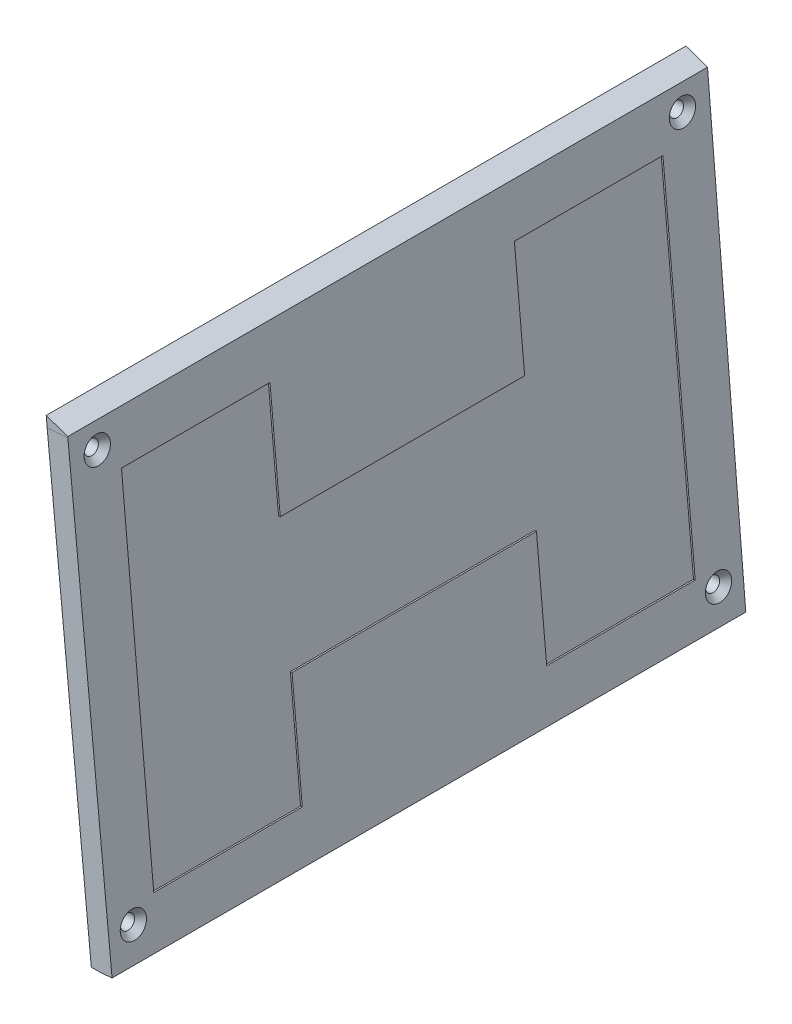
ISO-10303-21;
HEADER;
FILE_DESCRIPTION(('STEP AP214'),'2;1');
FILE_NAME('part.step','',(''),(''),'','','');
FILE_SCHEMA(('AUTOMOTIVE_DESIGN { 1 0 10303 214 1 1 1 1 }'));
ENDSEC;
DATA;
#1=APPLICATION_CONTEXT('core data for automotive mechanical design processes');
#2=APPLICATION_PROTOCOL_DEFINITION('international standard','automotive_design',2000,#1);
#3=PRODUCT_CONTEXT('',#1,'mechanical');
#4=PRODUCT('Part','Part','',(#3));
#5=PRODUCT_RELATED_PRODUCT_CATEGORY('part','',(#4));
#6=PRODUCT_DEFINITION_FORMATION('','',#4);
#7=PRODUCT_DEFINITION_CONTEXT('part definition',#1,'design');
#8=PRODUCT_DEFINITION('design','',#6,#7);
#9=PRODUCT_DEFINITION_SHAPE('','',#8);
#10=(LENGTH_UNIT() NAMED_UNIT(*) SI_UNIT(.MILLI.,.METRE.));
#11=(NAMED_UNIT(*) PLANE_ANGLE_UNIT() SI_UNIT($,.RADIAN.));
#12=(NAMED_UNIT(*) SI_UNIT($,.STERADIAN.) SOLID_ANGLE_UNIT());
#13=UNCERTAINTY_MEASURE_WITH_UNIT(LENGTH_MEASURE(1.E-05),#10,'distance_accuracy_value','');
#14=(GEOMETRIC_REPRESENTATION_CONTEXT(3) GLOBAL_UNCERTAINTY_ASSIGNED_CONTEXT((#13)) GLOBAL_UNIT_ASSIGNED_CONTEXT((#10,
#11,#12)) REPRESENTATION_CONTEXT('',''));
#15=CARTESIAN_POINT('',(0.,0.,0.));
#16=DIRECTION('',(0.,0.,1.));
#17=DIRECTION('',(1.,0.,0.));
#18=AXIS2_PLACEMENT_3D('',#15,#16,#17);
#19=CARTESIAN_POINT('',(178.098352013138,16.3444690138639,0.));
#20=DIRECTION('',(0.995815350334901,0.0913881175940254,0.));
#21=DIRECTION('',(-0.0913881175940254,0.995815350334901,0.));
#22=AXIS2_PLACEMENT_3D('',#19,#20,#21);
#23=PLANE('',#22);
#24=DIRECTION('',(0.,0.,1.));
#25=VECTOR('',#24,1.);
#26=CARTESIAN_POINT('',(170.741912243986,96.5042954639308,29.408644765289));
#27=LINE('',#26,#25);
#28=CARTESIAN_POINT('',(170.741912243986,96.5042954639308,29.408644765289));
#29=VERTEX_POINT('',#28);
#30=CARTESIAN_POINT('',(170.741912243986,96.5042954639308,65.1489376110085));
#31=VERTEX_POINT('',#30);
#32=EDGE_CURVE('E397',#29,#31,#27,.T.);
#33=ORIENTED_EDGE('',*,*,#32,.T.);
#34=DIRECTION('',(0.0913881175940254,-0.9958153503349,0.));
#35=VECTOR('',#34,1.);
#36=CARTESIAN_POINT('',(170.741912243986,96.5042954639308,65.1489376110085));
#37=LINE('',#36,#35);
#38=CARTESIAN_POINT('',(178.505016448738,11.9132289569812,65.1489376110085));
#39=VERTEX_POINT('',#38);
#40=EDGE_CURVE('E392',#31,#39,#37,.T.);
#41=ORIENTED_EDGE('',*,*,#40,.T.);
#42=DIRECTION('',(0.,0.,-1.));
#43=VECTOR('',#42,1.);
#44=CARTESIAN_POINT('',(178.505016448738,11.9132289569812,65.1489376110085));
#45=LINE('',#44,#43);
#46=CARTESIAN_POINT('',(178.505016448738,11.9132289569812,29.408644765289));
#47=VERTEX_POINT('',#46);
#48=EDGE_CURVE('E390',#39,#47,#45,.T.);
#49=ORIENTED_EDGE('',*,*,#48,.T.);
#50=DIRECTION('',(-0.0913881175940259,0.995815350334901,0.));
#51=VECTOR('',#50,1.);
#52=CARTESIAN_POINT('',(178.505016448738,11.9132289569812,29.408644765289));
#53=LINE('',#52,#51);
#54=CARTESIAN_POINT('',(176.046366702729,38.7040330859093,29.408644765289));
#55=VERTEX_POINT('',#54);
#56=EDGE_CURVE('E370',#47,#55,#53,.T.);
#57=ORIENTED_EDGE('',*,*,#56,.T.);
#58=DIRECTION('',(0.,0.,-1.));
#59=VECTOR('',#58,1.);
#60=CARTESIAN_POINT('',(176.046366702729,38.7040330859093,29.408644765289));
#61=LINE('',#60,#59);
#62=CARTESIAN_POINT('',(176.046366702729,38.7040330859093,-29.408644765289));
#63=VERTEX_POINT('',#62);
#64=EDGE_CURVE('E380',#55,#63,#61,.T.);
#65=ORIENTED_EDGE('',*,*,#64,.T.);
#66=DIRECTION('',(0.0913881175940259,-0.995815350334901,0.));
#67=VECTOR('',#66,1.);
#68=CARTESIAN_POINT('',(176.046366702729,38.7040330859093,-29.408644765289));
#69=LINE('',#68,#67);
#70=CARTESIAN_POINT('',(178.505016448738,11.9132289569812,-29.408644765289));
#71=VERTEX_POINT('',#70);
#72=EDGE_CURVE('E386',#63,#71,#69,.T.);
#73=ORIENTED_EDGE('',*,*,#72,.T.);
#74=DIRECTION('',(0.,0.,-1.));
#75=VECTOR('',#74,1.);
#76=CARTESIAN_POINT('',(178.505016448738,11.9132289569812,-29.408644765289));
#77=LINE('',#76,#75);
#78=CARTESIAN_POINT('',(178.505016448738,11.9132289569812,-65.1489376110086));
#79=VERTEX_POINT('',#78);
#80=EDGE_CURVE('E542',#71,#79,#77,.T.);
#81=ORIENTED_EDGE('',*,*,#80,.T.);
#82=DIRECTION('',(-0.0913881175940257,0.995815350334901,0.));
#83=VECTOR('',#82,1.);
#84=CARTESIAN_POINT('',(178.505016448738,11.9132289569812,-65.1489376110086));
#85=LINE('',#84,#83);
#86=CARTESIAN_POINT('',(170.741912243986,96.5042954639308,-65.1489376110086));
#87=VERTEX_POINT('',#86);
#88=EDGE_CURVE('E539',#79,#87,#85,.T.);
#89=ORIENTED_EDGE('',*,*,#88,.T.);
#90=DIRECTION('',(0.,0.,1.));
#91=VECTOR('',#90,1.);
#92=CARTESIAN_POINT('',(170.741912243986,96.5042954639308,-65.1489376110086));
#93=LINE('',#92,#91);
#94=CARTESIAN_POINT('',(170.741912243986,96.5042954639308,-29.408644765289));
#95=VERTEX_POINT('',#94);
#96=EDGE_CURVE('E536',#87,#95,#93,.T.);
#97=ORIENTED_EDGE('',*,*,#96,.T.);
#98=DIRECTION('',(0.0913881175940248,-0.9958153503349,0.));
#99=VECTOR('',#98,1.);
#100=CARTESIAN_POINT('',(170.741912243986,96.5042954639308,-29.408644765289));
#101=LINE('',#100,#99);
#102=CARTESIAN_POINT('',(173.200561989995,69.7134913350027,-29.408644765289));
#103=VERTEX_POINT('',#102);
#104=EDGE_CURVE('E533',#95,#103,#101,.T.);
#105=ORIENTED_EDGE('',*,*,#104,.T.);
#106=DIRECTION('',(0.,0.,1.));
#107=VECTOR('',#106,1.);
#108=CARTESIAN_POINT('',(173.200561989995,69.7134913350027,-29.408644765289));
#109=LINE('',#108,#107);
#110=CARTESIAN_POINT('',(173.200561989995,69.7134913350027,29.408644765289));
#111=VERTEX_POINT('',#110);
#112=EDGE_CURVE('E530',#103,#111,#109,.T.);
#113=ORIENTED_EDGE('',*,*,#112,.T.);
#114=DIRECTION('',(-0.0913881175940248,0.9958153503349,0.));
#115=VECTOR('',#114,1.);
#116=CARTESIAN_POINT('',(173.200561989995,69.7134913350027,29.408644765289));
#117=LINE('',#116,#115);
#118=EDGE_CURVE('E244',#111,#29,#117,.T.);
#119=ORIENTED_EDGE('',*,*,#118,.T.);
#120=EDGE_LOOP('',(#33,#41,#49,#57,#65,#73,#81,#89,#97,#105,#113,#119));
#121=FACE_BOUND('',#120,.T.);
#122=ADVANCED_FACE('F235',(#121),#23,.T.);
#123=CARTESIAN_POINT('',(178.505016448738,11.9132289569812,65.1489376110085));
#124=DIRECTION('',(0.0913881175940255,-0.995815350334901,0.));
#125=DIRECTION('',(0.995815350334901,0.0913881175940255,0.));
#126=AXIS2_PLACEMENT_3D('',#123,#124,#125);
#127=PLANE('',#126);
#128=DIRECTION('',(0.,0.,-1.));
#129=VECTOR('',#128,1.);
#130=CARTESIAN_POINT('',(178.903342588872,11.9497842040188,65.1489376110085));
#131=LINE('',#130,#129);
#132=CARTESIAN_POINT('',(178.903342588872,11.9497842040188,65.1489376110085));
#133=VERTEX_POINT('',#132);
#134=CARTESIAN_POINT('',(178.903342588872,11.9497842040188,29.408644765289));
#135=VERTEX_POINT('',#134);
#136=EDGE_CURVE('E483',#133,#135,#131,.T.);
#137=ORIENTED_EDGE('',*,*,#136,.T.);
#138=DIRECTION('',(0.995815350334901,0.0913881175940255,0.));
#139=VECTOR('',#138,1.);
#140=CARTESIAN_POINT('',(178.505016448738,11.9132289569812,29.408644765289));
#141=LINE('',#140,#139);
#142=EDGE_CURVE('E484',#47,#135,#141,.T.);
#143=ORIENTED_EDGE('',*,*,#142,.F.);
#144=ORIENTED_EDGE('',*,*,#48,.F.);
#145=DIRECTION('',(0.995815350334901,0.0913881175940255,0.));
#146=VECTOR('',#145,1.);
#147=CARTESIAN_POINT('',(178.505016448738,11.9132289569812,65.1489376110085));
#148=LINE('',#147,#146);
#149=EDGE_CURVE('E260',#39,#133,#148,.T.);
#150=ORIENTED_EDGE('',*,*,#149,.T.);
#151=EDGE_LOOP('',(#137,#143,#144,#150));
#152=FACE_BOUND('',#151,.T.);
#153=ADVANCED_FACE('F583',(#152),#127,.F.);
#154=CARTESIAN_POINT('',(178.505016448738,11.9132289569812,29.408644765289));
#155=DIRECTION('',(0.,0.,-1.));
#156=DIRECTION('',(-1.,0.,0.));
#157=AXIS2_PLACEMENT_3D('',#154,#155,#156);
#158=PLANE('',#157);
#159=DIRECTION('',(-0.0913881175940259,0.995815350334901,0.));
#160=VECTOR('',#159,1.);
#161=CARTESIAN_POINT('',(178.903342588872,11.9497842040188,29.408644765289));
#162=LINE('',#161,#160);
#163=CARTESIAN_POINT('',(176.444692842863,38.740588332947,29.408644765289));
#164=VERTEX_POINT('',#163);
#165=EDGE_CURVE('E373',#135,#164,#162,.T.);
#166=ORIENTED_EDGE('',*,*,#165,.T.);
#167=DIRECTION('',(0.995815350334901,0.0913881175940255,0.));
#168=VECTOR('',#167,1.);
#169=CARTESIAN_POINT('',(176.046366702729,38.7040330859093,29.408644765289));
#170=LINE('',#169,#168);
#171=EDGE_CURVE('E366',#55,#164,#170,.T.);
#172=ORIENTED_EDGE('',*,*,#171,.F.);
#173=ORIENTED_EDGE('',*,*,#56,.F.);
#174=ORIENTED_EDGE('',*,*,#142,.T.);
#175=EDGE_LOOP('',(#166,#172,#173,#174));
#176=FACE_BOUND('',#175,.T.);
#177=ADVANCED_FACE('F368',(#176),#158,.F.);
#178=CARTESIAN_POINT('',(176.046366702729,38.7040330859093,29.408644765289));
#179=DIRECTION('',(0.0913881175940255,-0.995815350334901,0.));
#180=DIRECTION('',(0.995815350334901,0.0913881175940255,0.));
#181=AXIS2_PLACEMENT_3D('',#178,#179,#180);
#182=PLANE('',#181);
#183=DIRECTION('',(0.,0.,-1.));
#184=VECTOR('',#183,1.);
#185=CARTESIAN_POINT('',(176.444692842863,38.740588332947,29.408644765289));
#186=LINE('',#185,#184);
#187=CARTESIAN_POINT('',(176.444692842863,38.740588332947,-29.408644765289));
#188=VERTEX_POINT('',#187);
#189=EDGE_CURVE('E377',#164,#188,#186,.T.);
#190=ORIENTED_EDGE('',*,*,#189,.T.);
#191=DIRECTION('',(0.995815350334901,0.0913881175940255,0.));
#192=VECTOR('',#191,1.);
#193=CARTESIAN_POINT('',(176.046366702729,38.7040330859093,-29.408644765289));
#194=LINE('',#193,#192);
#195=EDGE_CURVE('E382',#63,#188,#194,.T.);
#196=ORIENTED_EDGE('',*,*,#195,.F.);
#197=ORIENTED_EDGE('',*,*,#64,.F.);
#198=ORIENTED_EDGE('',*,*,#171,.T.);
#199=EDGE_LOOP('',(#190,#196,#197,#198));
#200=FACE_BOUND('',#199,.T.);
#201=ADVANCED_FACE('F381',(#200),#182,.F.);
#202=CARTESIAN_POINT('',(176.046366702729,38.7040330859093,-29.408644765289));
#203=DIRECTION('',(0.,0.,1.));
#204=DIRECTION('',(0.,-1.,0.));
#205=AXIS2_PLACEMENT_3D('',#202,#203,#204);
#206=PLANE('',#205);
#207=DIRECTION('',(0.0913881175940259,-0.995815350334901,0.));
#208=VECTOR('',#207,1.);
#209=CARTESIAN_POINT('',(176.444692842863,38.740588332947,-29.408644765289));
#210=LINE('',#209,#208);
#211=CARTESIAN_POINT('',(178.903342588872,11.9497842040188,-29.408644765289));
#212=VERTEX_POINT('',#211);
#213=EDGE_CURVE('E487',#188,#212,#210,.T.);
#214=ORIENTED_EDGE('',*,*,#213,.T.);
#215=DIRECTION('',(0.995815350334901,0.0913881175940255,0.));
#216=VECTOR('',#215,1.);
#217=CARTESIAN_POINT('',(178.505016448738,11.9132289569812,-29.408644765289));
#218=LINE('',#217,#216);
#219=EDGE_CURVE('E488',#71,#212,#218,.T.);
#220=ORIENTED_EDGE('',*,*,#219,.F.);
#221=ORIENTED_EDGE('',*,*,#72,.F.);
#222=ORIENTED_EDGE('',*,*,#195,.T.);
#223=EDGE_LOOP('',(#214,#220,#221,#222));
#224=FACE_BOUND('',#223,.T.);
#225=ADVANCED_FACE('F546',(#224),#206,.F.);
#226=CARTESIAN_POINT('',(178.505016448738,11.9132289569812,-29.408644765289));
#227=DIRECTION('',(0.0913881175940255,-0.995815350334901,0.));
#228=DIRECTION('',(0.995815350334901,0.0913881175940255,0.));
#229=AXIS2_PLACEMENT_3D('',#226,#227,#228);
#230=PLANE('',#229);
#231=DIRECTION('',(0.,0.,-1.));
#232=VECTOR('',#231,1.);
#233=CARTESIAN_POINT('',(178.903342588872,11.9497842040188,-29.408644765289));
#234=LINE('',#233,#232);
#235=CARTESIAN_POINT('',(178.903342588872,11.9497842040188,-65.1489376110086));
#236=VERTEX_POINT('',#235);
#237=EDGE_CURVE('E490',#212,#236,#234,.T.);
#238=ORIENTED_EDGE('',*,*,#237,.T.);
#239=DIRECTION('',(0.995815350334901,0.0913881175940255,0.));
#240=VECTOR('',#239,1.);
#241=CARTESIAN_POINT('',(178.505016448738,11.9132289569812,-65.1489376110086));
#242=LINE('',#241,#240);
#243=EDGE_CURVE('E491',#79,#236,#242,.T.);
#244=ORIENTED_EDGE('',*,*,#243,.F.);
#245=ORIENTED_EDGE('',*,*,#80,.F.);
#246=ORIENTED_EDGE('',*,*,#219,.T.);
#247=EDGE_LOOP('',(#238,#244,#245,#246));
#248=FACE_BOUND('',#247,.T.);
#249=ADVANCED_FACE('F550',(#248),#230,.F.);
#250=CARTESIAN_POINT('',(178.505016448738,11.9132289569812,-65.1489376110086));
#251=DIRECTION('',(0.,0.,-1.));
#252=DIRECTION('',(-1.,0.,0.));
#253=AXIS2_PLACEMENT_3D('',#250,#251,#252);
#254=PLANE('',#253);
#255=DIRECTION('',(-0.0913881175940257,0.995815350334901,0.));
#256=VECTOR('',#255,1.);
#257=CARTESIAN_POINT('',(178.903342588872,11.9497842040188,-65.1489376110086));
#258=LINE('',#257,#256);
#259=CARTESIAN_POINT('',(171.14023838412,96.5408507109684,-65.1489376110086));
#260=VERTEX_POINT('',#259);
#261=EDGE_CURVE('E493',#236,#260,#258,.T.);
#262=ORIENTED_EDGE('',*,*,#261,.T.);
#263=DIRECTION('',(0.995815350334901,0.0913881175940255,0.));
#264=VECTOR('',#263,1.);
#265=CARTESIAN_POINT('',(170.741912243986,96.5042954639308,-65.1489376110086));
#266=LINE('',#265,#264);
#267=EDGE_CURVE('E494',#87,#260,#266,.T.);
#268=ORIENTED_EDGE('',*,*,#267,.F.);
#269=ORIENTED_EDGE('',*,*,#88,.F.);
#270=ORIENTED_EDGE('',*,*,#243,.T.);
#271=EDGE_LOOP('',(#262,#268,#269,#270));
#272=FACE_BOUND('',#271,.T.);
#273=ADVANCED_FACE('F554',(#272),#254,.F.);
#274=CARTESIAN_POINT('',(170.741912243986,96.5042954639308,-65.1489376110086));
#275=DIRECTION('',(-0.0913881175940255,0.995815350334901,0.));
#276=DIRECTION('',(-0.995815350334901,-0.0913881175940255,0.));
#277=AXIS2_PLACEMENT_3D('',#274,#275,#276);
#278=PLANE('',#277);
#279=DIRECTION('',(0.,0.,1.));
#280=VECTOR('',#279,1.);
#281=CARTESIAN_POINT('',(171.14023838412,96.5408507109684,-65.1489376110086));
#282=LINE('',#281,#280);
#283=CARTESIAN_POINT('',(171.14023838412,96.5408507109684,-29.408644765289));
#284=VERTEX_POINT('',#283);
#285=EDGE_CURVE('E496',#260,#284,#282,.T.);
#286=ORIENTED_EDGE('',*,*,#285,.T.);
#287=DIRECTION('',(0.995815350334901,0.0913881175940255,0.));
#288=VECTOR('',#287,1.);
#289=CARTESIAN_POINT('',(170.741912243986,96.5042954639308,-29.408644765289));
#290=LINE('',#289,#288);
#291=EDGE_CURVE('E497',#95,#284,#290,.T.);
#292=ORIENTED_EDGE('',*,*,#291,.F.);
#293=ORIENTED_EDGE('',*,*,#96,.F.);
#294=ORIENTED_EDGE('',*,*,#267,.T.);
#295=EDGE_LOOP('',(#286,#292,#293,#294));
#296=FACE_BOUND('',#295,.T.);
#297=ADVANCED_FACE('F558',(#296),#278,.F.);
#298=CARTESIAN_POINT('',(170.741912243986,96.5042954639308,-29.408644765289));
#299=DIRECTION('',(0.,0.,1.));
#300=DIRECTION('',(1.,0.,0.));
#301=AXIS2_PLACEMENT_3D('',#298,#299,#300);
#302=PLANE('',#301);
#303=DIRECTION('',(0.0913881175940248,-0.9958153503349,0.));
#304=VECTOR('',#303,1.);
#305=CARTESIAN_POINT('',(171.14023838412,96.5408507109684,-29.408644765289));
#306=LINE('',#305,#304);
#307=CARTESIAN_POINT('',(173.598888130129,69.7500465820403,-29.408644765289));
#308=VERTEX_POINT('',#307);
#309=EDGE_CURVE('E499',#284,#308,#306,.T.);
#310=ORIENTED_EDGE('',*,*,#309,.T.);
#311=DIRECTION('',(0.995815350334901,0.0913881175940255,0.));
#312=VECTOR('',#311,1.);
#313=CARTESIAN_POINT('',(173.200561989995,69.7134913350027,-29.408644765289));
#314=LINE('',#313,#312);
#315=EDGE_CURVE('E500',#103,#308,#314,.T.);
#316=ORIENTED_EDGE('',*,*,#315,.F.);
#317=ORIENTED_EDGE('',*,*,#104,.F.);
#318=ORIENTED_EDGE('',*,*,#291,.T.);
#319=EDGE_LOOP('',(#310,#316,#317,#318));
#320=FACE_BOUND('',#319,.T.);
#321=ADVANCED_FACE('F562',(#320),#302,.F.);
#322=CARTESIAN_POINT('',(173.200561989995,69.7134913350027,-29.408644765289));
#323=DIRECTION('',(-0.0913881175940255,0.995815350334901,0.));
#324=DIRECTION('',(-0.995815350334901,-0.0913881175940255,0.));
#325=AXIS2_PLACEMENT_3D('',#322,#323,#324);
#326=PLANE('',#325);
#327=DIRECTION('',(0.,0.,1.));
#328=VECTOR('',#327,1.);
#329=CARTESIAN_POINT('',(173.598888130129,69.7500465820403,-29.408644765289));
#330=LINE('',#329,#328);
#331=CARTESIAN_POINT('',(173.598888130129,69.7500465820403,29.408644765289));
#332=VERTEX_POINT('',#331);
#333=EDGE_CURVE('E502',#308,#332,#330,.T.);
#334=ORIENTED_EDGE('',*,*,#333,.T.);
#335=DIRECTION('',(0.995815350334901,0.0913881175940255,0.));
#336=VECTOR('',#335,1.);
#337=CARTESIAN_POINT('',(173.200561989995,69.7134913350027,29.408644765289));
#338=LINE('',#337,#336);
#339=EDGE_CURVE('E503',#111,#332,#338,.T.);
#340=ORIENTED_EDGE('',*,*,#339,.F.);
#341=ORIENTED_EDGE('',*,*,#112,.F.);
#342=ORIENTED_EDGE('',*,*,#315,.T.);
#343=EDGE_LOOP('',(#334,#340,#341,#342));
#344=FACE_BOUND('',#343,.T.);
#345=ADVANCED_FACE('F566',(#344),#326,.F.);
#346=CARTESIAN_POINT('',(173.200561989995,69.7134913350027,29.408644765289));
#347=DIRECTION('',(0.,0.,-1.));
#348=DIRECTION('',(-1.,0.,0.));
#349=AXIS2_PLACEMENT_3D('',#346,#347,#348);
#350=PLANE('',#349);
#351=DIRECTION('',(-0.0913881175940248,0.9958153503349,0.));
#352=VECTOR('',#351,1.);
#353=CARTESIAN_POINT('',(173.598888130129,69.7500465820403,29.408644765289));
#354=LINE('',#353,#352);
#355=CARTESIAN_POINT('',(171.14023838412,96.5408507109684,29.408644765289));
#356=VERTEX_POINT('',#355);
#357=EDGE_CURVE('E505',#332,#356,#354,.T.);
#358=ORIENTED_EDGE('',*,*,#357,.T.);
#359=DIRECTION('',(0.995815350334901,0.0913881175940255,0.));
#360=VECTOR('',#359,1.);
#361=CARTESIAN_POINT('',(170.741912243986,96.5042954639308,29.408644765289));
#362=LINE('',#361,#360);
#363=EDGE_CURVE('E506',#29,#356,#362,.T.);
#364=ORIENTED_EDGE('',*,*,#363,.F.);
#365=ORIENTED_EDGE('',*,*,#118,.F.);
#366=ORIENTED_EDGE('',*,*,#339,.T.);
#367=EDGE_LOOP('',(#358,#364,#365,#366));
#368=FACE_BOUND('',#367,.T.);
#369=ADVANCED_FACE('F569',(#368),#350,.F.);
#370=CARTESIAN_POINT('',(170.741912243986,96.5042954639308,29.408644765289));
#371=DIRECTION('',(-0.0913881175940255,0.995815350334901,0.));
#372=DIRECTION('',(-0.995815350334901,-0.0913881175940255,0.));
#373=AXIS2_PLACEMENT_3D('',#370,#371,#372);
#374=PLANE('',#373);
#375=DIRECTION('',(0.,0.,1.));
#376=VECTOR('',#375,1.);
#377=CARTESIAN_POINT('',(171.14023838412,96.5408507109684,29.408644765289));
#378=LINE('',#377,#376);
#379=CARTESIAN_POINT('',(171.14023838412,96.5408507109684,65.1489376110085));
#380=VERTEX_POINT('',#379);
#381=EDGE_CURVE('E404',#356,#380,#378,.T.);
#382=ORIENTED_EDGE('',*,*,#381,.T.);
#383=DIRECTION('',(0.995815350334901,0.0913881175940255,0.));
#384=VECTOR('',#383,1.);
#385=CARTESIAN_POINT('',(170.741912243986,96.5042954639308,65.1489376110085));
#386=LINE('',#385,#384);
#387=EDGE_CURVE('E399',#31,#380,#386,.T.);
#388=ORIENTED_EDGE('',*,*,#387,.F.);
#389=ORIENTED_EDGE('',*,*,#32,.F.);
#390=ORIENTED_EDGE('',*,*,#363,.T.);
#391=EDGE_LOOP('',(#382,#388,#389,#390));
#392=FACE_BOUND('',#391,.T.);
#393=ADVANCED_FACE('F574',(#392),#374,.F.);
#394=CARTESIAN_POINT('',(170.741912243986,96.5042954639308,65.1489376110085));
#395=DIRECTION('',(0.,0.,1.));
#396=DIRECTION('',(0.,-1.,0.));
#397=AXIS2_PLACEMENT_3D('',#394,#395,#396);
#398=PLANE('',#397);
#399=DIRECTION('',(0.0913881175940254,-0.9958153503349,0.));
#400=VECTOR('',#399,1.);
#401=CARTESIAN_POINT('',(171.14023838412,96.5408507109684,65.1489376110085));
#402=LINE('',#401,#400);
#403=EDGE_CURVE('E481',#380,#133,#402,.T.);
#404=ORIENTED_EDGE('',*,*,#403,.T.);
#405=ORIENTED_EDGE('',*,*,#149,.F.);
#406=ORIENTED_EDGE('',*,*,#40,.F.);
#407=ORIENTED_EDGE('',*,*,#387,.T.);
#408=EDGE_LOOP('',(#404,#405,#406,#407));
#409=FACE_BOUND('',#408,.T.);
#410=ADVANCED_FACE('F575',(#409),#398,.F.);
#411=CARTESIAN_POINT('',(-177.016203335942,-32.5130946842192,76.2516685303765));
#412=DIRECTION('',(0.0913881175940254,-0.9958153503349,0.));
#413=DIRECTION('',(0.995815350334901,0.0913881175940254,0.));
#414=AXIS2_PLACEMENT_3D('',#411,#412,#413);
#415=PLANE('',#414);
#416=DIRECTION('',(0.,0.,-1.));
#417=VECTOR('',#416,1.);
#418=CARTESIAN_POINT('',(177.264414602448,0.,0.));
#419=LINE('',#418,#417);
#420=CARTESIAN_POINT('',(177.264414602452,1.70002900645727E-13,76.2516685303765));
#421=VERTEX_POINT('',#420);
#422=CARTESIAN_POINT('',(177.264414602448,0.,-76.2516685303765));
#423=VERTEX_POINT('',#422);
#424=EDGE_CURVE('E400',#421,#423,#419,.T.);
#425=ORIENTED_EDGE('',*,*,#424,.T.);
#426=DIRECTION('',(0.9958153503349,0.0913881175940254,0.));
#427=VECTOR('',#426,1.);
#428=CARTESIAN_POINT('',(-177.016203335942,-32.5130946842192,-76.2516685303765));
#429=LINE('',#428,#427);
#430=CARTESIAN_POINT('',(179.977152970602,0.248953837583731,-76.2516685303765));
#431=VERTEX_POINT('',#430);
#432=EDGE_CURVE('E402',#423,#431,#429,.T.);
#433=ORIENTED_EDGE('',*,*,#432,.T.);
#434=DIRECTION('',(0.,0.,-1.));
#435=VECTOR('',#434,1.);
#436=CARTESIAN_POINT('',(179.977152970602,0.248953837583728,76.2516685303765));
#437=LINE('',#436,#435);
#438=CARTESIAN_POINT('',(179.977152970602,0.248953837583728,76.2516685303765));
#439=VERTEX_POINT('',#438);
#440=EDGE_CURVE('E428',#439,#431,#437,.T.);
#441=ORIENTED_EDGE('',*,*,#440,.F.);
#442=DIRECTION('',(0.9958153503349,0.0913881175940254,0.));
#443=VECTOR('',#442,1.);
#444=CARTESIAN_POINT('',(-177.016203335942,-32.5130946842192,76.2516685303765));
#445=LINE('',#444,#443);
#446=EDGE_CURVE('E413',#421,#439,#445,.T.);
#447=ORIENTED_EDGE('',*,*,#446,.F.);
#448=EDGE_LOOP('',(#425,#433,#441,#447));
#449=FACE_BOUND('',#448,.T.);
#450=ADVANCED_FACE('F621',(#449),#415,.T.);
#451=CARTESIAN_POINT('',(180.,0.,-95.0000000000001));
#452=DIRECTION('',(-0.9958153503349,-0.0913881175940254,0.));
#453=DIRECTION('',(0.0913881175940254,-0.995815350334901,0.));
#454=AXIS2_PLACEMENT_3D('',#451,#452,#453);
#455=PLANE('',#454);
#456=CARTESIAN_POINT('',(170.5775863283,102.671817939909,70.41));
#457=DIRECTION('',(0.995815350334901,0.0913881175940254,0.));
#458=DIRECTION('',(-0.0913881175940254,0.995815350334901,0.));
#459=AXIS2_PLACEMENT_3D('',#456,#457,#458);
#460=CIRCLE('',#459,3.15);
#461=CARTESIAN_POINT('',(170.289713757879,105.808636293463,70.41));
#462=VERTEX_POINT('',#461);
#463=EDGE_CURVE('E950',#462,#462,#460,.T.);
#464=ORIENTED_EDGE('',*,*,#463,.F.);
#465=EDGE_LOOP('',(#464));
#466=FACE_BOUND('',#465,.T.);
#467=CARTESIAN_POINT('',(179.259457499732,8.06935965809293,70.41));
#468=DIRECTION('',(0.995815350334901,0.0913881175940254,0.));
#469=DIRECTION('',(-0.0913881175940254,0.995815350334901,0.));
#470=AXIS2_PLACEMENT_3D('',#467,#468,#469);
#471=CIRCLE('',#470,3.15);
#472=CARTESIAN_POINT('',(178.971584929311,11.2061780116479,70.41));
#473=VERTEX_POINT('',#472);
#474=EDGE_CURVE('E453',#473,#473,#471,.T.);
#475=ORIENTED_EDGE('',*,*,#474,.F.);
#476=EDGE_LOOP('',(#475));
#477=FACE_BOUND('',#476,.T.);
#478=CARTESIAN_POINT('',(179.259457499732,8.06935965809293,-70.41));
#479=DIRECTION('',(0.995815350334901,0.0913881175940254,0.));
#480=DIRECTION('',(-0.0913881175940254,0.995815350334901,0.));
#481=AXIS2_PLACEMENT_3D('',#478,#479,#480);
#482=CIRCLE('',#481,3.15);
#483=CARTESIAN_POINT('',(178.971584929311,11.2061780116479,-70.41));
#484=VERTEX_POINT('',#483);
#485=EDGE_CURVE('E446',#484,#484,#482,.T.);
#486=ORIENTED_EDGE('',*,*,#485,.F.);
#487=EDGE_LOOP('',(#486));
#488=FACE_BOUND('',#487,.T.);
#489=CARTESIAN_POINT('',(170.5775863283,102.671817939908,-70.41));
#490=DIRECTION('',(0.995815350334901,0.0913881175940254,0.));
#491=DIRECTION('',(-0.0913881175940254,0.995815350334901,0.));
#492=AXIS2_PLACEMENT_3D('',#489,#490,#491);
#493=CIRCLE('',#492,3.15);
#494=CARTESIAN_POINT('',(170.289713757879,105.808636293463,-70.41));
#495=VERTEX_POINT('',#494);
#496=EDGE_CURVE('E442',#495,#495,#493,.T.);
#497=ORIENTED_EDGE('',*,*,#496,.F.);
#498=EDGE_LOOP('',(#497));
#499=FACE_BOUND('',#498,.T.);
#500=ORIENTED_EDGE('',*,*,#403,.F.);
#501=ORIENTED_EDGE('',*,*,#381,.F.);
#502=ORIENTED_EDGE('',*,*,#357,.F.);
#503=ORIENTED_EDGE('',*,*,#333,.F.);
#504=ORIENTED_EDGE('',*,*,#309,.F.);
#505=ORIENTED_EDGE('',*,*,#285,.F.);
#506=ORIENTED_EDGE('',*,*,#261,.F.);
#507=ORIENTED_EDGE('',*,*,#237,.F.);
#508=ORIENTED_EDGE('',*,*,#213,.F.);
#509=ORIENTED_EDGE('',*,*,#189,.F.);
#510=ORIENTED_EDGE('',*,*,#165,.F.);
#511=ORIENTED_EDGE('',*,*,#136,.F.);
#512=EDGE_LOOP('',(#500,#501,#502,#503,#504,#505,#506,#507,#508,#509,#510,#511));
#513=FACE_BOUND('',#512,.T.);
#514=DIRECTION('',(-0.0913881175940234,0.995815350334901,0.));
#515=VECTOR('',#514,1.);
#516=CARTESIAN_POINT('',(169.238202815486,117.266479665736,-76.9778854461506));
#517=LINE('',#516,#515);
#518=CARTESIAN_POINT('',(170.06642800239,108.241681077404,-76.9778854461506));
#519=VERTEX_POINT('',#518);
#520=CARTESIAN_POINT('',(170.043580972992,108.490634914987,-76.9778854461506));
#521=VERTEX_POINT('',#520);
#522=EDGE_CURVE('E420',#519,#521,#517,.T.);
#523=ORIENTED_EDGE('',*,*,#522,.T.);
#524=DIRECTION('',(0.,0.,-1.));
#525=VECTOR('',#524,1.);
#526=CARTESIAN_POINT('',(170.043580972992,108.490634914987,-95.0000000000001));
#527=LINE('',#526,#525);
#528=CARTESIAN_POINT('',(170.043580972992,108.490634914987,76.9778854461506));
#529=VERTEX_POINT('',#528);
#530=EDGE_CURVE('E408',#529,#521,#527,.T.);
#531=ORIENTED_EDGE('',*,*,#530,.F.);
#532=DIRECTION('',(0.0913881175940233,-0.995815350334901,0.));
#533=VECTOR('',#532,1.);
#534=CARTESIAN_POINT('',(170.06642800239,108.241681077403,76.9778854461506));
#535=LINE('',#534,#533);
#536=CARTESIAN_POINT('',(170.06642800239,108.241681077403,76.9778854461506));
#537=VERTEX_POINT('',#536);
#538=EDGE_CURVE('E424',#529,#537,#535,.T.);
#539=ORIENTED_EDGE('',*,*,#538,.T.);
#540=DIRECTION('',(0.0913860685727561,-0.995793023068648,-0.00669639295576177));
#541=VECTOR('',#540,1.);
#542=CARTESIAN_POINT('',(177.982054127997,21.9886515707881,76.3978611179811));
#543=LINE('',#542,#541);
#544=EDGE_CURVE('E431',#537,#439,#543,.T.);
#545=ORIENTED_EDGE('',*,*,#544,.T.);
#546=ORIENTED_EDGE('',*,*,#440,.T.);
#547=DIRECTION('',(-0.0913860685727555,0.995793023068648,-0.00669639295576247));
#548=VECTOR('',#547,1.);
#549=CARTESIAN_POINT('',(177.982054127997,21.9886515707881,-76.3978611179811));
#550=LINE('',#549,#548);
#551=EDGE_CURVE('E425',#431,#519,#550,.T.);
#552=ORIENTED_EDGE('',*,*,#551,.T.);
#553=EDGE_LOOP('',(#523,#531,#539,#545,#546,#552));
#554=FACE_BOUND('',#553,.T.);
#555=ADVANCED_FACE('F579',(#466,#477,#488,#499,#513,#554),#455,.F.);
#556=CARTESIAN_POINT('',(64.,145.66860274162,95.));
#557=DIRECTION('',(0.330847570538663,0.943684208339137,0.));
#558=DIRECTION('',(-0.943684208339137,0.330847570538664,0.));
#559=AXIS2_PLACEMENT_3D('',#556,#557,#558);
#560=PLANE('',#559);
#561=DIRECTION('',(0.,0.,-1.));
#562=VECTOR('',#561,1.);
#563=CARTESIAN_POINT('',(164.855650591621,110.309478705773,95.));
#564=LINE('',#563,#562);
#565=CARTESIAN_POINT('',(164.855650591621,110.309478705773,76.9778854461506));
#566=VERTEX_POINT('',#565);
#567=CARTESIAN_POINT('',(164.855650591621,110.309478705773,-76.9778854461506));
#568=VERTEX_POINT('',#567);
#569=EDGE_CURVE('E12',#566,#568,#564,.T.);
#570=ORIENTED_EDGE('',*,*,#569,.F.);
#571=DIRECTION('',(0.943684208339137,-0.330847570538664,0.));
#572=VECTOR('',#571,1.);
#573=CARTESIAN_POINT('',(64.,145.66860274162,76.9778854461506));
#574=LINE('',#573,#572);
#575=EDGE_CURVE('E303',#566,#529,#574,.T.);
#576=ORIENTED_EDGE('',*,*,#575,.T.);
#577=ORIENTED_EDGE('',*,*,#530,.T.);
#578=DIRECTION('',(-0.943684208339137,0.330847570538664,0.));
#579=VECTOR('',#578,1.);
#580=CARTESIAN_POINT('',(63.9999999999998,145.668602741621,-76.9778854461505));
#581=LINE('',#580,#579);
#582=EDGE_CURVE('E405',#521,#568,#581,.T.);
#583=ORIENTED_EDGE('',*,*,#582,.T.);
#584=EDGE_LOOP('',(#570,#576,#577,#583));
#585=FACE_BOUND('',#584,.T.);
#586=ADVANCED_FACE('F614',(#585),#560,.T.);
#587=CARTESIAN_POINT('',(-186.926928304153,75.4796325556005,76.9778854461506));
#588=DIRECTION('',(0.,0.,1.));
#589=DIRECTION('',(1.,0.,0.));
#590=AXIS2_PLACEMENT_3D('',#587,#588,#589);
#591=PLANE('',#590);
#592=DIRECTION('',(-0.0913881175940255,0.995815350334901,0.));
#593=VECTOR('',#592,1.);
#594=CARTESIAN_POINT('',(165.087351250716,107.784740489433,76.9778854461506));
#595=LINE('',#594,#593);
#596=CARTESIAN_POINT('',(165.087351250716,107.784740489433,76.9778854461506));
#597=VERTEX_POINT('',#596);
#598=EDGE_CURVE('E251',#597,#566,#595,.T.);
#599=ORIENTED_EDGE('',*,*,#598,.F.);
#600=DIRECTION('',(0.9958153503349,0.0913881175940254,0.));
#601=VECTOR('',#600,1.);
#602=CARTESIAN_POINT('',(-186.926928304153,75.4796325556005,76.9778854461506));
#603=LINE('',#602,#601);
#604=EDGE_CURVE('E296',#597,#537,#603,.T.);
#605=ORIENTED_EDGE('',*,*,#604,.T.);
#606=ORIENTED_EDGE('',*,*,#538,.F.);
#607=ORIENTED_EDGE('',*,*,#575,.F.);
#608=EDGE_LOOP('',(#599,#605,#606,#607));
#609=FACE_BOUND('',#608,.T.);
#610=ADVANCED_FACE('F611',(#609),#591,.T.);
#611=CARTESIAN_POINT('',(-187.755153491057,84.5044311439332,-76.9778854461506));
#612=DIRECTION('',(0.,0.,-1.));
#613=DIRECTION('',(0.,1.,0.));
#614=AXIS2_PLACEMENT_3D('',#611,#612,#613);
#615=PLANE('',#614);
#616=DIRECTION('',(0.0913881175940255,-0.995815350334901,0.));
#617=VECTOR('',#616,1.);
#618=CARTESIAN_POINT('',(164.259126063812,116.809539077766,-76.9778854461506));
#619=LINE('',#618,#617);
#620=CARTESIAN_POINT('',(165.087351250716,107.784740489433,-76.9778854461506));
#621=VERTEX_POINT('',#620);
#622=EDGE_CURVE('E468',#568,#621,#619,.T.);
#623=ORIENTED_EDGE('',*,*,#622,.F.);
#624=ORIENTED_EDGE('',*,*,#582,.F.);
#625=ORIENTED_EDGE('',*,*,#522,.F.);
#626=DIRECTION('',(0.9958153503349,0.0913881175940254,0.));
#627=VECTOR('',#626,1.);
#628=CARTESIAN_POINT('',(-186.926928304153,75.4796325556006,-76.9778854461506));
#629=LINE('',#628,#627);
#630=EDGE_CURVE('E412',#621,#519,#629,.T.);
#631=ORIENTED_EDGE('',*,*,#630,.F.);
#632=EDGE_LOOP('',(#623,#624,#625,#631));
#633=FACE_BOUND('',#632,.T.);
#634=ADVANCED_FACE('F237',(#633),#615,.T.);
#635=CARTESIAN_POINT('',(-179.011302178546,-10.7733969510148,-76.3978611179811));
#636=DIRECTION('',(0.000611970746897025,-0.00666837089722277,-0.999977578909338));
#637=DIRECTION('',(0.,0.99997776615929,-0.00666837214590289));
#638=AXIS2_PLACEMENT_3D('',#635,#636,#637);
#639=PLANE('',#638);
#640=DIRECTION('',(0.0913860685727555,-0.995793023068648,0.00669639295576248));
#641=VECTOR('',#640,1.);
#642=CARTESIAN_POINT('',(173.002977376323,21.531710982818,-76.3978611179811));
#643=LINE('',#642,#641);
#644=CARTESIAN_POINT('',(174.978988827278,-1.03042574473022E-12,-76.2530671754542));
#645=VERTEX_POINT('',#644);
#646=EDGE_CURVE('E471',#621,#645,#643,.T.);
#647=ORIENTED_EDGE('',*,*,#646,.F.);
#648=ORIENTED_EDGE('',*,*,#630,.T.);
#649=ORIENTED_EDGE('',*,*,#551,.F.);
#650=ORIENTED_EDGE('',*,*,#432,.F.);
#651=DIRECTION('',(-0.999999812737558,0.,-0.000611984353654565));
#652=VECTOR('',#651,1.);
#653=CARTESIAN_POINT('',(0.0467312092702079,0.,-76.3601230001135));
#654=LINE('',#653,#652);
#655=EDGE_CURVE('E409',#423,#645,#654,.T.);
#656=ORIENTED_EDGE('',*,*,#655,.T.);
#657=EDGE_LOOP('',(#647,#648,#649,#650,#656));
#658=FACE_BOUND('',#657,.T.);
#659=ADVANCED_FACE('F619',(#658),#639,.T.);
#660=CARTESIAN_POINT('',(-179.011302178546,-10.7733969510149,76.3978611179811));
#661=DIRECTION('',(0.00061197074689696,-0.00666837089722207,0.999977578909338));
#662=DIRECTION('',(0.,-0.99997776615929,-0.00666837214590219));
#663=AXIS2_PLACEMENT_3D('',#660,#661,#662);
#664=PLANE('',#663);
#665=DIRECTION('',(-0.0913860685727555,0.995793023068648,0.00669639295576177));
#666=VECTOR('',#665,1.);
#667=CARTESIAN_POINT('',(173.002977376323,21.531710982818,76.3978611179811));
#668=LINE('',#667,#666);
#669=CARTESIAN_POINT('',(174.978988827278,-1.11022302462516E-12,76.2530671754542));
#670=VERTEX_POINT('',#669);
#671=EDGE_CURVE('E474',#670,#597,#668,.T.);
#672=ORIENTED_EDGE('',*,*,#671,.F.);
#673=DIRECTION('',(0.999999812737558,0.,-0.0006119843536545));
#674=VECTOR('',#673,1.);
#675=CARTESIAN_POINT('',(0.0467312092702029,0.,76.3601230001134));
#676=LINE('',#675,#674);
#677=EDGE_CURVE('E414',#670,#421,#676,.T.);
#678=ORIENTED_EDGE('',*,*,#677,.T.);
#679=ORIENTED_EDGE('',*,*,#446,.T.);
#680=ORIENTED_EDGE('',*,*,#544,.F.);
#681=ORIENTED_EDGE('',*,*,#604,.F.);
#682=EDGE_LOOP('',(#672,#678,#679,#680,#681));
#683=FACE_BOUND('',#682,.T.);
#684=ADVANCED_FACE('F615',(#683),#664,.T.);
#685=CARTESIAN_POINT('',(0.,0.,0.));
#686=DIRECTION('',(0.,1.,0.));
#687=DIRECTION('',(0.,0.,1.));
#688=AXIS2_PLACEMENT_3D('',#685,#686,#687);
#689=PLANE('',#688);
#690=ORIENTED_EDGE('',*,*,#677,.F.);
#691=DIRECTION('',(0.,0.,-1.));
#692=VECTOR('',#691,1.);
#693=CARTESIAN_POINT('',(174.978988827278,0.,0.));
#694=LINE('',#693,#692);
#695=EDGE_CURVE('E416',#670,#645,#694,.T.);
#696=ORIENTED_EDGE('',*,*,#695,.T.);
#697=ORIENTED_EDGE('',*,*,#655,.F.);
#698=ORIENTED_EDGE('',*,*,#424,.F.);
#699=EDGE_LOOP('',(#690,#696,#697,#698));
#700=FACE_BOUND('',#699,.T.);
#701=ADVANCED_FACE('F618',(#700),#689,.F.);
#702=CARTESIAN_POINT('',(175.020923248325,-0.456940587970127,-95.0000000000001));
#703=DIRECTION('',(-0.9958153503349,-0.0913881175940254,0.));
#704=DIRECTION('',(0.0913881175940254,-0.995815350334901,0.));
#705=AXIS2_PLACEMENT_3D('',#702,#703,#704);
#706=PLANE('',#705);
#707=CARTESIAN_POINT('',(165.598509576625,102.214877351938,70.41));
#708=DIRECTION('',(-0.9958153503349,-0.0913881175940254,0.));
#709=DIRECTION('',(0.0913881175940254,-0.995815350334901,0.));
#710=AXIS2_PLACEMENT_3D('',#707,#708,#709);
#711=CIRCLE('',#710,1.69999999999999);
#712=CARTESIAN_POINT('',(165.753869376535,100.521991256369,70.41));
#713=VERTEX_POINT('',#712);
#714=EDGE_CURVE('E239',#713,#713,#711,.T.);
#715=ORIENTED_EDGE('',*,*,#714,.F.);
#716=EDGE_LOOP('',(#715));
#717=FACE_BOUND('',#716,.T.);
#718=CARTESIAN_POINT('',(174.280380748057,7.61241907012279,70.41));
#719=DIRECTION('',(-0.9958153503349,-0.0913881175940254,0.));
#720=DIRECTION('',(0.0913881175940254,-0.995815350334901,0.));
#721=AXIS2_PLACEMENT_3D('',#718,#719,#720);
#722=CIRCLE('',#721,1.69999999999999);
#723=CARTESIAN_POINT('',(174.435740547967,5.91953297455347,70.41));
#724=VERTEX_POINT('',#723);
#725=EDGE_CURVE('E444',#724,#724,#722,.T.);
#726=ORIENTED_EDGE('',*,*,#725,.F.);
#727=EDGE_LOOP('',(#726));
#728=FACE_BOUND('',#727,.T.);
#729=CARTESIAN_POINT('',(174.280380748057,7.61241907012279,-70.41));
#730=DIRECTION('',(-0.9958153503349,-0.0913881175940254,0.));
#731=DIRECTION('',(0.0913881175940254,-0.995815350334901,0.));
#732=AXIS2_PLACEMENT_3D('',#729,#730,#731);
#733=CIRCLE('',#732,1.69999999999999);
#734=CARTESIAN_POINT('',(174.435740547967,5.91953297455347,-70.41));
#735=VERTEX_POINT('',#734);
#736=EDGE_CURVE('E440',#735,#735,#733,.T.);
#737=ORIENTED_EDGE('',*,*,#736,.F.);
#738=EDGE_LOOP('',(#737));
#739=FACE_BOUND('',#738,.T.);
#740=CARTESIAN_POINT('',(165.598509576625,102.214877351938,-70.41));
#741=DIRECTION('',(-0.9958153503349,-0.0913881175940254,0.));
#742=DIRECTION('',(0.0913881175940254,-0.995815350334901,0.));
#743=AXIS2_PLACEMENT_3D('',#740,#741,#742);
#744=CIRCLE('',#743,1.69999999999999);
#745=CARTESIAN_POINT('',(165.753869376535,100.521991256369,-70.41));
#746=VERTEX_POINT('',#745);
#747=EDGE_CURVE('E436',#746,#746,#744,.T.);
#748=ORIENTED_EDGE('',*,*,#747,.F.);
#749=EDGE_LOOP('',(#748));
#750=FACE_BOUND('',#749,.T.);
#751=ORIENTED_EDGE('',*,*,#671,.T.);
#752=ORIENTED_EDGE('',*,*,#598,.T.);
#753=ORIENTED_EDGE('',*,*,#569,.T.);
#754=ORIENTED_EDGE('',*,*,#622,.T.);
#755=ORIENTED_EDGE('',*,*,#646,.T.);
#756=ORIENTED_EDGE('',*,*,#695,.F.);
#757=EDGE_LOOP('',(#751,#752,#753,#754,#755,#756));
#758=FACE_BOUND('',#757,.T.);
#759=ADVANCED_FACE('F649',(#717,#728,#739,#750,#758),#706,.T.);
#760=CARTESIAN_POINT('',(170.5775863283,102.671817939908,-70.41));
#761=DIRECTION('',(0.995815350334901,0.0913881175940254,0.));
#762=DIRECTION('',(-0.0913881175940254,0.995815350334901,0.));
#763=AXIS2_PLACEMENT_3D('',#760,#761,#762);
#764=CYLINDRICAL_SURFACE('',#763,1.69999999999999);
#765=ORIENTED_EDGE('',*,*,#747,.T.);
#766=EDGE_LOOP('',(#765));
#767=FACE_BOUND('',#766,.T.);
#768=CARTESIAN_POINT('',(169.133654070314,102.539305169397,-70.41));
#769=DIRECTION('',(0.995815350334901,0.0913881175940254,0.));
#770=DIRECTION('',(-0.0913881175940254,0.995815350334901,0.));
#771=AXIS2_PLACEMENT_3D('',#768,#769,#770);
#772=CIRCLE('',#771,1.69999999999999);
#773=CARTESIAN_POINT('',(168.978294270404,104.232191264966,-70.41));
#774=VERTEX_POINT('',#773);
#775=EDGE_CURVE('E439',#774,#774,#772,.T.);
#776=ORIENTED_EDGE('',*,*,#775,.T.);
#777=EDGE_LOOP('',(#776));
#778=FACE_BOUND('',#777,.T.);
#779=ADVANCED_FACE('F663',(#767,#778),#764,.F.);
#780=CARTESIAN_POINT('',(170.5775863283,102.671817939908,-70.41));
#781=DIRECTION('',(0.995815350334901,0.0913881175940254,0.));
#782=DIRECTION('',(-0.0913881175940254,0.995815350334901,0.));
#783=AXIS2_PLACEMENT_3D('',#780,#781,#782);
#784=CONICAL_SURFACE('',#783,3.15,0.785398163397448);
#785=ORIENTED_EDGE('',*,*,#775,.F.);
#786=EDGE_LOOP('',(#785));
#787=FACE_BOUND('',#786,.T.);
#788=ORIENTED_EDGE('',*,*,#496,.T.);
#789=EDGE_LOOP('',(#788));
#790=FACE_BOUND('',#789,.T.);
#791=ADVANCED_FACE('F704',(#787,#790),#784,.F.);
#792=CARTESIAN_POINT('',(179.259457499732,8.06935965809293,-70.41));
#793=DIRECTION('',(0.995815350334901,0.0913881175940254,0.));
#794=DIRECTION('',(-0.0913881175940254,0.995815350334901,0.));
#795=AXIS2_PLACEMENT_3D('',#792,#793,#794);
#796=CYLINDRICAL_SURFACE('',#795,1.69999999999999);
#797=ORIENTED_EDGE('',*,*,#736,.T.);
#798=EDGE_LOOP('',(#797));
#799=FACE_BOUND('',#798,.T.);
#800=CARTESIAN_POINT('',(177.815525241746,7.93684688758159,-70.41));
#801=DIRECTION('',(0.995815350334901,0.0913881175940254,0.));
#802=DIRECTION('',(-0.0913881175940254,0.995815350334901,0.));
#803=AXIS2_PLACEMENT_3D('',#800,#801,#802);
#804=CIRCLE('',#803,1.69999999999999);
#805=CARTESIAN_POINT('',(177.660165441837,9.62973298315092,-70.41));
#806=VERTEX_POINT('',#805);
#807=EDGE_CURVE('E443',#806,#806,#804,.T.);
#808=ORIENTED_EDGE('',*,*,#807,.T.);
#809=EDGE_LOOP('',(#808));
#810=FACE_BOUND('',#809,.T.);
#811=ADVANCED_FACE('F715',(#799,#810),#796,.F.);
#812=CARTESIAN_POINT('',(179.259457499732,8.06935965809293,-70.41));
#813=DIRECTION('',(0.995815350334901,0.0913881175940254,0.));
#814=DIRECTION('',(-0.0913881175940254,0.995815350334901,0.));
#815=AXIS2_PLACEMENT_3D('',#812,#813,#814);
#816=CONICAL_SURFACE('',#815,3.15,0.785398163397448);
#817=ORIENTED_EDGE('',*,*,#807,.F.);
#818=EDGE_LOOP('',(#817));
#819=FACE_BOUND('',#818,.T.);
#820=ORIENTED_EDGE('',*,*,#485,.T.);
#821=EDGE_LOOP('',(#820));
#822=FACE_BOUND('',#821,.T.);
#823=ADVANCED_FACE('F726',(#819,#822),#816,.F.);
#824=CARTESIAN_POINT('',(179.259457499732,8.06935965809293,70.41));
#825=DIRECTION('',(0.995815350334901,0.0913881175940254,0.));
#826=DIRECTION('',(-0.0913881175940254,0.995815350334901,0.));
#827=AXIS2_PLACEMENT_3D('',#824,#825,#826);
#828=CYLINDRICAL_SURFACE('',#827,1.69999999999999);
#829=ORIENTED_EDGE('',*,*,#725,.T.);
#830=EDGE_LOOP('',(#829));
#831=FACE_BOUND('',#830,.T.);
#832=CARTESIAN_POINT('',(177.815525241746,7.93684688758159,70.41));
#833=DIRECTION('',(0.995815350334901,0.0913881175940254,0.));
#834=DIRECTION('',(-0.0913881175940254,0.995815350334901,0.));
#835=AXIS2_PLACEMENT_3D('',#832,#833,#834);
#836=CIRCLE('',#835,1.69999999999999);
#837=CARTESIAN_POINT('',(177.660165441837,9.62973298315092,70.41));
#838=VERTEX_POINT('',#837);
#839=EDGE_CURVE('E447',#838,#838,#836,.T.);
#840=ORIENTED_EDGE('',*,*,#839,.T.);
#841=EDGE_LOOP('',(#840));
#842=FACE_BOUND('',#841,.T.);
#843=ADVANCED_FACE('F737',(#831,#842),#828,.F.);
#844=CARTESIAN_POINT('',(179.259457499732,8.06935965809293,70.41));
#845=DIRECTION('',(0.995815350334901,0.0913881175940254,0.));
#846=DIRECTION('',(-0.0913881175940254,0.995815350334901,0.));
#847=AXIS2_PLACEMENT_3D('',#844,#845,#846);
#848=CONICAL_SURFACE('',#847,3.15,0.785398163397448);
#849=ORIENTED_EDGE('',*,*,#839,.F.);
#850=EDGE_LOOP('',(#849));
#851=FACE_BOUND('',#850,.T.);
#852=ORIENTED_EDGE('',*,*,#474,.T.);
#853=EDGE_LOOP('',(#852));
#854=FACE_BOUND('',#853,.T.);
#855=ADVANCED_FACE('F748',(#851,#854),#848,.F.);
#856=CARTESIAN_POINT('',(170.5775863283,102.671817939909,70.41));
#857=DIRECTION('',(0.995815350334901,0.0913881175940254,0.));
#858=DIRECTION('',(-0.0913881175940254,0.995815350334901,0.));
#859=AXIS2_PLACEMENT_3D('',#856,#857,#858);
#860=CYLINDRICAL_SURFACE('',#859,1.69999999999999);
#861=ORIENTED_EDGE('',*,*,#714,.T.);
#862=EDGE_LOOP('',(#861));
#863=FACE_BOUND('',#862,.T.);
#864=CARTESIAN_POINT('',(169.133654070314,102.539305169397,70.41));
#865=DIRECTION('',(0.995815350334901,0.0913881175940254,0.));
#866=DIRECTION('',(-0.0913881175940254,0.995815350334901,0.));
#867=AXIS2_PLACEMENT_3D('',#864,#865,#866);
#868=CIRCLE('',#867,1.69999999999999);
#869=CARTESIAN_POINT('',(168.978294270404,104.232191264966,70.41));
#870=VERTEX_POINT('',#869);
#871=EDGE_CURVE('E947',#870,#870,#868,.T.);
#872=ORIENTED_EDGE('',*,*,#871,.T.);
#873=EDGE_LOOP('',(#872));
#874=FACE_BOUND('',#873,.T.);
#875=ADVANCED_FACE('F758',(#863,#874),#860,.F.);
#876=CARTESIAN_POINT('',(170.5775863283,102.671817939909,70.41));
#877=DIRECTION('',(0.995815350334901,0.0913881175940254,0.));
#878=DIRECTION('',(-0.0913881175940254,0.995815350334901,0.));
#879=AXIS2_PLACEMENT_3D('',#876,#877,#878);
#880=CONICAL_SURFACE('',#879,3.15,0.785398163397448);
#881=ORIENTED_EDGE('',*,*,#871,.F.);
#882=EDGE_LOOP('',(#881));
#883=FACE_BOUND('',#882,.T.);
#884=ORIENTED_EDGE('',*,*,#463,.T.);
#885=EDGE_LOOP('',(#884));
#886=FACE_BOUND('',#885,.T.);
#887=ADVANCED_FACE('F769',(#883,#886),#880,.F.);
#888=CLOSED_SHELL('',(#122,#153,#177,#201,#225,#249,#273,#297,#321,#345,#369,#393,#410,#450,
#555,#586,#610,#634,#659,#684,#701,#759,#779,#791,#811,#823,#843,#855,#875,#887));
#889=MANIFOLD_SOLID_BREP('B2',#888);
#890=ADVANCED_BREP_SHAPE_REPRESENTATION('',(#18,#889),#14);
#891=SHAPE_DEFINITION_REPRESENTATION(#9,#890);
ENDSEC;
END-ISO-10303-21;
